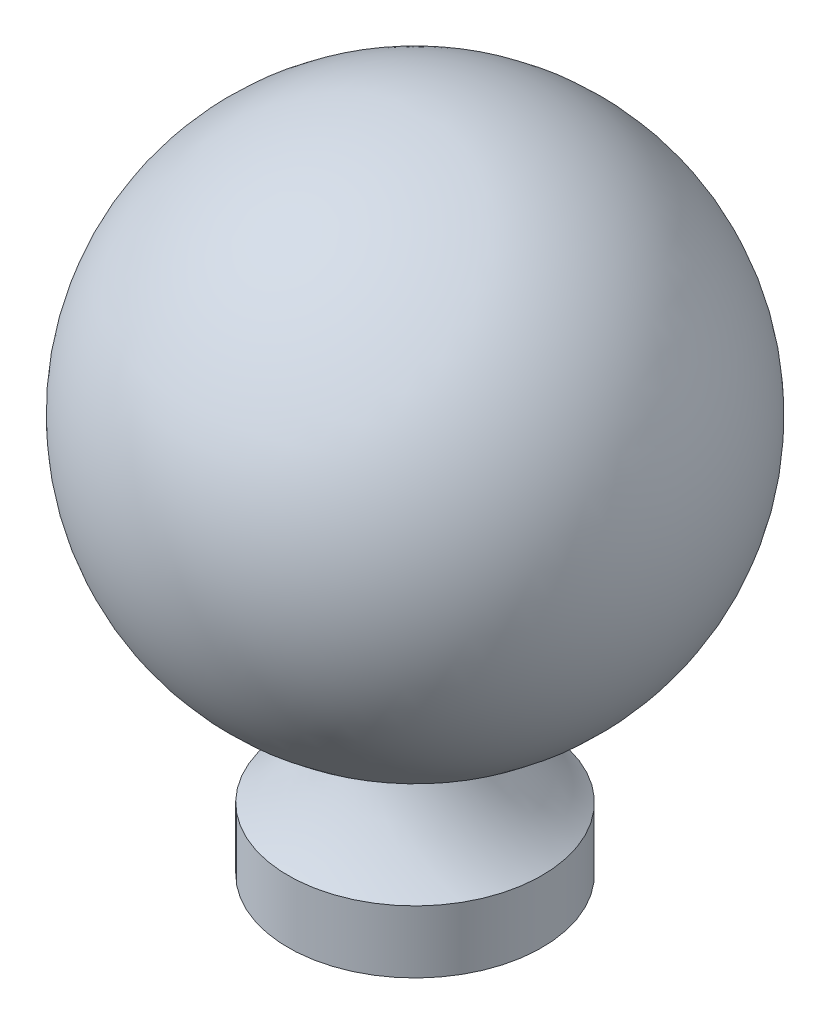
ISO-10303-21;
HEADER;
FILE_DESCRIPTION(('STEP AP214'),'2;1');
FILE_NAME('part.step','',(''),(''),'','','');
FILE_SCHEMA(('AUTOMOTIVE_DESIGN { 1 0 10303 214 1 1 1 1 }'));
ENDSEC;
DATA;
#1=APPLICATION_CONTEXT('core data for automotive mechanical design processes');
#2=APPLICATION_PROTOCOL_DEFINITION('international standard','automotive_design',2000,#1);
#3=PRODUCT_CONTEXT('',#1,'mechanical');
#4=PRODUCT('Part','Part','',(#3));
#5=PRODUCT_RELATED_PRODUCT_CATEGORY('part','',(#4));
#6=PRODUCT_DEFINITION_FORMATION('','',#4);
#7=PRODUCT_DEFINITION_CONTEXT('part definition',#1,'design');
#8=PRODUCT_DEFINITION('design','',#6,#7);
#9=PRODUCT_DEFINITION_SHAPE('','',#8);
#10=(LENGTH_UNIT() NAMED_UNIT(*) SI_UNIT(.MILLI.,.METRE.));
#11=(NAMED_UNIT(*) PLANE_ANGLE_UNIT() SI_UNIT($,.RADIAN.));
#12=(NAMED_UNIT(*) SI_UNIT($,.STERADIAN.) SOLID_ANGLE_UNIT());
#13=UNCERTAINTY_MEASURE_WITH_UNIT(LENGTH_MEASURE(1.E-05),#10,'distance_accuracy_value','');
#14=(GEOMETRIC_REPRESENTATION_CONTEXT(3) GLOBAL_UNCERTAINTY_ASSIGNED_CONTEXT((#13)) GLOBAL_UNIT_ASSIGNED_CONTEXT((#10,
#11,#12)) REPRESENTATION_CONTEXT('',''));
#15=CARTESIAN_POINT('',(0.,0.,0.));
#16=DIRECTION('',(0.,0.,1.));
#17=DIRECTION('',(1.,0.,0.));
#18=AXIS2_PLACEMENT_3D('',#15,#16,#17);
#19=CARTESIAN_POINT('',(0.,8.77,0.));
#20=DIRECTION('',(0.,-1.,0.));
#21=DIRECTION('',(1.,0.,0.));
#22=AXIS2_PLACEMENT_3D('',#19,#20,#21);
#23=SPHERICAL_SURFACE('',#22,5.75);
#24=CARTESIAN_POINT('',(0.,3.23626668356372,0.));
#25=DIRECTION('',(0.,-1.,0.));
#26=DIRECTION('',(0.,0.,-1.));
#27=AXIS2_PLACEMENT_3D('',#24,#25,#26);
#28=CIRCLE('',#27,1.56214454598897);
#29=CARTESIAN_POINT('',(0.,3.23626668356372,-1.56214454598897));
#30=VERTEX_POINT('',#29);
#31=EDGE_CURVE('E10',#30,#30,#28,.T.);
#32=ORIENTED_EDGE('',*,*,#31,.F.);
#33=EDGE_LOOP('',(#32));
#34=FACE_BOUND('',#33,.T.);
#35=ADVANCED_FACE('F30',(#34),#23,.T.);
#36=CARTESIAN_POINT('',(0.,3.18814726342079,0.));
#37=DIRECTION('',(0.,-1.,0.));
#38=DIRECTION('',(0.,0.,-1.));
#39=AXIS2_PLACEMENT_3D('',#36,#37,#38);
#40=TOROIDAL_SURFACE('',#39,1.57572841160626,0.05);
#41=ORIENTED_EDGE('',*,*,#31,.T.);
#42=EDGE_LOOP('',(#41));
#43=FACE_BOUND('',#42,.T.);
#44=CARTESIAN_POINT('',(0.,3.17239921063848,0.));
#45=DIRECTION('',(0.,-1.,0.));
#46=DIRECTION('',(0.,0.,-1.));
#47=AXIS2_PLACEMENT_3D('',#44,#45,#46);
#48=CIRCLE('',#47,1.52827318182528);
#49=CARTESIAN_POINT('',(0.,3.17239921063848,-1.52827318182528));
#50=VERTEX_POINT('',#49);
#51=EDGE_CURVE('E36',#50,#50,#48,.T.);
#52=ORIENTED_EDGE('',*,*,#51,.F.);
#53=EDGE_LOOP('',(#52));
#54=FACE_BOUND('',#53,.T.);
#55=ADVANCED_FACE('F62',(#43,#54),#40,.F.);
#56=CARTESIAN_POINT('',(0.,4.3692512220943,0.));
#57=DIRECTION('',(0.,-1.,0.));
#58=DIRECTION('',(0.,0.,-1.));
#59=AXIS2_PLACEMENT_3D('',#56,#57,#58);
#60=TOROIDAL_SURFACE('',#59,5.13487064517965,3.8);
#61=ORIENTED_EDGE('',*,*,#51,.T.);
#62=EDGE_LOOP('',(#61));
#63=FACE_BOUND('',#62,.T.);
#64=CARTESIAN_POINT('',(0.,1.37508934206401,0.));
#65=DIRECTION('',(0.,-1.,0.));
#66=DIRECTION('',(0.,0.,-1.));
#67=AXIS2_PLACEMENT_3D('',#64,#65,#66);
#68=CIRCLE('',#67,2.795);
#69=CARTESIAN_POINT('',(0.,1.37508934206401,-2.795));
#70=VERTEX_POINT('',#69);
#71=EDGE_CURVE('E40',#70,#70,#68,.T.);
#72=ORIENTED_EDGE('',*,*,#71,.F.);
#73=EDGE_LOOP('',(#72));
#74=FACE_BOUND('',#73,.T.);
#75=ADVANCED_FACE('F54',(#63,#74),#60,.F.);
#76=CARTESIAN_POINT('',(0.,0.,0.));
#77=DIRECTION('',(0.,-1.,0.));
#78=DIRECTION('',(0.,0.,-1.));
#79=AXIS2_PLACEMENT_3D('',#76,#77,#78);
#80=CYLINDRICAL_SURFACE('',#79,2.795);
#81=ORIENTED_EDGE('',*,*,#71,.T.);
#82=EDGE_LOOP('',(#81));
#83=FACE_BOUND('',#82,.T.);
#84=CARTESIAN_POINT('',(0.,0.,0.));
#85=DIRECTION('',(0.,-1.,0.));
#86=DIRECTION('',(0.,0.,-1.));
#87=AXIS2_PLACEMENT_3D('',#84,#85,#86);
#88=CIRCLE('',#87,2.795);
#89=CARTESIAN_POINT('',(0.,0.,-2.795));
#90=VERTEX_POINT('',#89);
#91=EDGE_CURVE('E44',#90,#90,#88,.T.);
#92=ORIENTED_EDGE('',*,*,#91,.F.);
#93=EDGE_LOOP('',(#92));
#94=FACE_BOUND('',#93,.T.);
#95=ADVANCED_FACE('F52',(#83,#94),#80,.T.);
#96=CARTESIAN_POINT('',(0.,0.,0.));
#97=DIRECTION('',(0.,-1.,0.));
#98=DIRECTION('',(0.,0.,-1.));
#99=AXIS2_PLACEMENT_3D('',#96,#97,#98);
#100=PLANE('',#99);
#101=ORIENTED_EDGE('',*,*,#91,.T.);
#102=EDGE_LOOP('',(#101));
#103=FACE_BOUND('',#102,.T.);
#104=ADVANCED_FACE('F50',(#103),#100,.T.);
#105=CLOSED_SHELL('',(#35,#55,#75,#95,#104));
#106=MANIFOLD_SOLID_BREP('B2',#105);
#107=ADVANCED_BREP_SHAPE_REPRESENTATION('',(#18,#106),#14);
#108=SHAPE_DEFINITION_REPRESENTATION(#9,#107);
ENDSEC;
END-ISO-10303-21;
